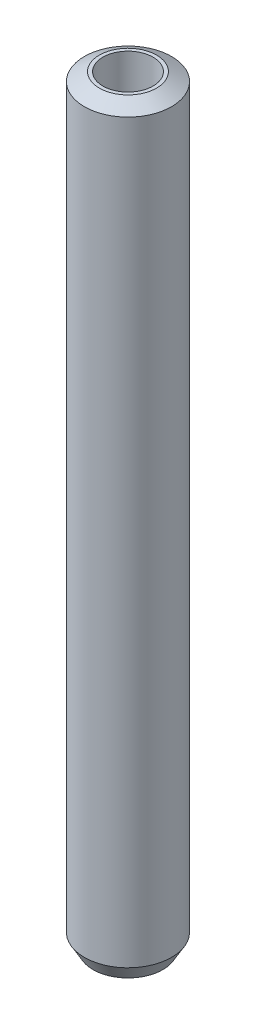
ISO-10303-21;
HEADER;
FILE_DESCRIPTION(('STEP AP214'),'2;1');
FILE_NAME('part.step','',(''),(''),'','','');
FILE_SCHEMA(('AUTOMOTIVE_DESIGN { 1 0 10303 214 1 1 1 1 }'));
ENDSEC;
DATA;
#1=APPLICATION_CONTEXT('core data for automotive mechanical design processes');
#2=APPLICATION_PROTOCOL_DEFINITION('international standard','automotive_design',2000,#1);
#3=PRODUCT_CONTEXT('',#1,'mechanical');
#4=PRODUCT('Part','Part','',(#3));
#5=PRODUCT_RELATED_PRODUCT_CATEGORY('part','',(#4));
#6=PRODUCT_DEFINITION_FORMATION('','',#4);
#7=PRODUCT_DEFINITION_CONTEXT('part definition',#1,'design');
#8=PRODUCT_DEFINITION('design','',#6,#7);
#9=PRODUCT_DEFINITION_SHAPE('','',#8);
#10=(LENGTH_UNIT() NAMED_UNIT(*) SI_UNIT(.MILLI.,.METRE.));
#11=(NAMED_UNIT(*) PLANE_ANGLE_UNIT() SI_UNIT($,.RADIAN.));
#12=(NAMED_UNIT(*) SI_UNIT($,.STERADIAN.) SOLID_ANGLE_UNIT());
#13=UNCERTAINTY_MEASURE_WITH_UNIT(LENGTH_MEASURE(1.E-05),#10,'distance_accuracy_value','');
#14=(GEOMETRIC_REPRESENTATION_CONTEXT(3) GLOBAL_UNCERTAINTY_ASSIGNED_CONTEXT((#13)) GLOBAL_UNIT_ASSIGNED_CONTEXT((#10,
#11,#12)) REPRESENTATION_CONTEXT('',''));
#15=CARTESIAN_POINT('',(0.,0.,0.));
#16=DIRECTION('',(0.,0.,1.));
#17=DIRECTION('',(1.,0.,0.));
#18=AXIS2_PLACEMENT_3D('',#15,#16,#17);
#19=CARTESIAN_POINT('',(0.,392.68697991489,0.));
#20=DIRECTION('',(0.,-1.,0.));
#21=DIRECTION('',(0.,0.,-1.));
#22=AXIS2_PLACEMENT_3D('',#19,#20,#21);
#23=CYLINDRICAL_SURFACE('',#22,22.5);
#24=CARTESIAN_POINT('',(0.,388.23127279759,0.));
#25=DIRECTION('',(0.,1.,0.));
#26=DIRECTION('',(0.,0.,1.));
#27=AXIS2_PLACEMENT_3D('',#24,#25,#26);
#28=CIRCLE('',#27,22.5);
#29=CARTESIAN_POINT('',(0.,388.23127279759,22.5));
#30=VERTEX_POINT('',#29);
#31=EDGE_CURVE('E50',#30,#30,#28,.F.);
#32=ORIENTED_EDGE('',*,*,#31,.T.);
#33=EDGE_LOOP('',(#32));
#34=FACE_BOUND('',#33,.T.);
#35=CARTESIAN_POINT('',(0.,7.71751111080976,0.));
#36=DIRECTION('',(0.,1.,0.));
#37=DIRECTION('',(0.,0.,1.));
#38=AXIS2_PLACEMENT_3D('',#35,#36,#37);
#39=CIRCLE('',#38,22.5);
#40=CARTESIAN_POINT('',(0.,7.71751111080976,22.5));
#41=VERTEX_POINT('',#40);
#42=EDGE_CURVE('E51',#41,#41,#39,.T.);
#43=ORIENTED_EDGE('',*,*,#42,.T.);
#44=EDGE_LOOP('',(#43));
#45=FACE_BOUND('',#44,.T.);
#46=ADVANCED_FACE('F39',(#34,#45),#23,.T.);
#47=CARTESIAN_POINT('',(0.,392.68697991489,0.));
#48=DIRECTION('',(0.,1.,0.));
#49=DIRECTION('',(0.,0.,1.));
#50=AXIS2_PLACEMENT_3D('',#47,#48,#49);
#51=PLANE('',#50);
#52=CARTESIAN_POINT('',(0.,392.68697991489,0.));
#53=DIRECTION('',(0.,1.,0.));
#54=DIRECTION('',(0.,0.,1.));
#55=AXIS2_PLACEMENT_3D('',#52,#53,#54);
#56=CIRCLE('',#55,14.7824888891903);
#57=CARTESIAN_POINT('',(0.,392.68697991489,14.7824888891903));
#58=VERTEX_POINT('',#57);
#59=EDGE_CURVE('E54',#58,#58,#56,.T.);
#60=ORIENTED_EDGE('',*,*,#59,.T.);
#61=EDGE_LOOP('',(#60));
#62=FACE_BOUND('',#61,.T.);
#63=CARTESIAN_POINT('',(0.,392.68697991489,0.));
#64=DIRECTION('',(0.,1.,0.));
#65=DIRECTION('',(0.,0.,1.));
#66=AXIS2_PLACEMENT_3D('',#63,#64,#65);
#67=CIRCLE('',#66,12.9593034457423);
#68=CARTESIAN_POINT('',(0.,392.68697991489,12.9593034457423));
#69=VERTEX_POINT('',#68);
#70=EDGE_CURVE('E58',#69,#69,#67,.T.);
#71=ORIENTED_EDGE('',*,*,#70,.F.);
#72=EDGE_LOOP('',(#71));
#73=FACE_BOUND('',#72,.T.);
#74=ADVANCED_FACE('F69',(#62,#73),#51,.T.);
#75=CARTESIAN_POINT('',(0.,0.,0.));
#76=DIRECTION('',(0.,1.,0.));
#77=DIRECTION('',(0.,0.,1.));
#78=AXIS2_PLACEMENT_3D('',#75,#76,#77);
#79=PLANE('',#78);
#80=CARTESIAN_POINT('',(0.,0.,0.));
#81=DIRECTION('',(0.,1.,0.));
#82=DIRECTION('',(0.,0.,1.));
#83=AXIS2_PLACEMENT_3D('',#80,#81,#82);
#84=CIRCLE('',#83,18.0442928827);
#85=CARTESIAN_POINT('',(0.,0.,18.0442928827));
#86=VERTEX_POINT('',#85);
#87=EDGE_CURVE('E10',#86,#86,#84,.F.);
#88=ORIENTED_EDGE('',*,*,#87,.T.);
#89=EDGE_LOOP('',(#88));
#90=FACE_BOUND('',#89,.T.);
#91=CARTESIAN_POINT('',(0.,0.,0.));
#92=DIRECTION('',(0.,1.,0.));
#93=DIRECTION('',(0.,0.,1.));
#94=AXIS2_PLACEMENT_3D('',#91,#92,#93);
#95=CIRCLE('',#94,12.9593034457423);
#96=CARTESIAN_POINT('',(0.,0.,12.9593034457423));
#97=VERTEX_POINT('',#96);
#98=EDGE_CURVE('E63',#97,#97,#95,.T.);
#99=ORIENTED_EDGE('',*,*,#98,.T.);
#100=EDGE_LOOP('',(#99));
#101=FACE_BOUND('',#100,.T.);
#102=ADVANCED_FACE('F75',(#90,#101),#79,.F.);
#103=CARTESIAN_POINT('',(0.,392.68697991489,0.));
#104=DIRECTION('',(0.,-1.,0.));
#105=DIRECTION('',(0.,0.,-1.));
#106=AXIS2_PLACEMENT_3D('',#103,#104,#105);
#107=CYLINDRICAL_SURFACE('',#106,12.9593034457423);
#108=ORIENTED_EDGE('',*,*,#70,.T.);
#109=EDGE_LOOP('',(#108));
#110=FACE_BOUND('',#109,.T.);
#111=ORIENTED_EDGE('',*,*,#98,.F.);
#112=EDGE_LOOP('',(#111));
#113=FACE_BOUND('',#112,.T.);
#114=ADVANCED_FACE('F70',(#110,#113),#107,.F.);
#115=CARTESIAN_POINT('',(0.,392.68697991489,0.));
#116=DIRECTION('',(0.,-1.,0.));
#117=DIRECTION('',(0.,0.,-1.));
#118=AXIS2_PLACEMENT_3D('',#115,#116,#117);
#119=CONICAL_SURFACE('',#118,14.7824888891903,1.04719755119659);
#120=ORIENTED_EDGE('',*,*,#31,.F.);
#121=EDGE_LOOP('',(#120));
#122=FACE_BOUND('',#121,.T.);
#123=ORIENTED_EDGE('',*,*,#59,.F.);
#124=EDGE_LOOP('',(#123));
#125=FACE_BOUND('',#124,.T.);
#126=ADVANCED_FACE('F81',(#122,#125),#119,.T.);
#127=CARTESIAN_POINT('',(0.,7.71751111080976,0.));
#128=DIRECTION('',(0.,1.,0.));
#129=DIRECTION('',(0.,0.,1.));
#130=AXIS2_PLACEMENT_3D('',#127,#128,#129);
#131=CONICAL_SURFACE('',#130,22.5,0.523598775598303);
#132=ORIENTED_EDGE('',*,*,#87,.F.);
#133=EDGE_LOOP('',(#132));
#134=FACE_BOUND('',#133,.T.);
#135=ORIENTED_EDGE('',*,*,#42,.F.);
#136=EDGE_LOOP('',(#135));
#137=FACE_BOUND('',#136,.T.);
#138=ADVANCED_FACE('F45',(#134,#137),#131,.T.);
#139=CLOSED_SHELL('',(#46,#74,#102,#114,#126,#138));
#140=MANIFOLD_SOLID_BREP('B2',#139);
#141=ADVANCED_BREP_SHAPE_REPRESENTATION('',(#18,#140),#14);
#142=SHAPE_DEFINITION_REPRESENTATION(#9,#141);
ENDSEC;
END-ISO-10303-21;
